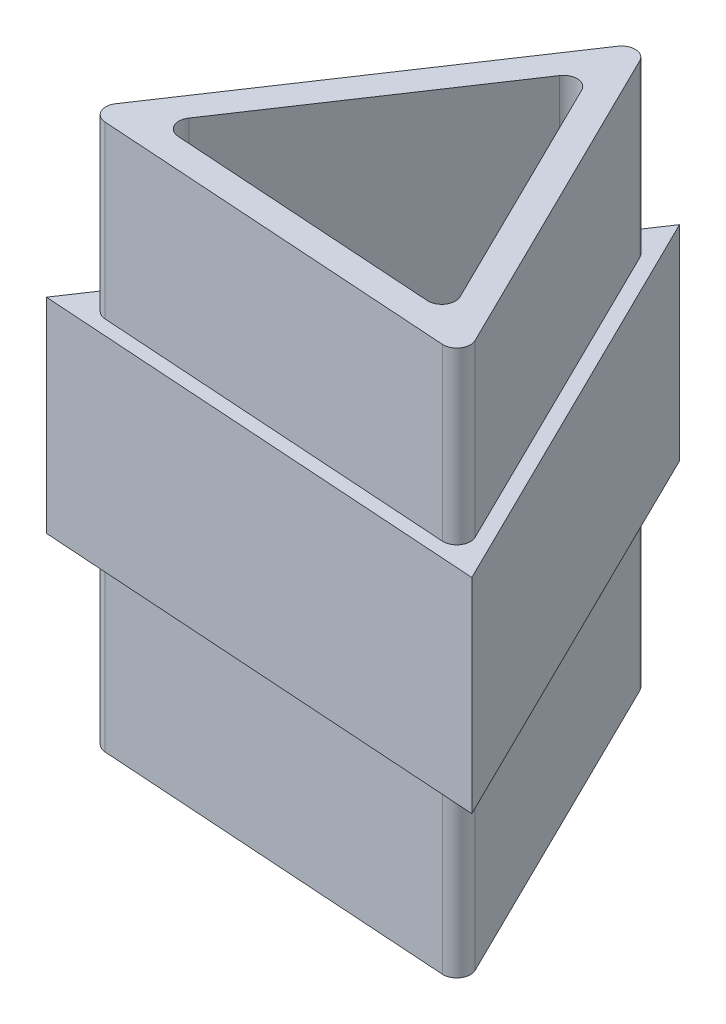
ISO-10303-21;
HEADER;
FILE_DESCRIPTION(('STEP AP214'),'2;1');
FILE_NAME('part.step','',(''),(''),'','','');
FILE_SCHEMA(('AUTOMOTIVE_DESIGN { 1 0 10303 214 1 1 1 1 }'));
ENDSEC;
DATA;
#1=APPLICATION_CONTEXT('core data for automotive mechanical design processes');
#2=APPLICATION_PROTOCOL_DEFINITION('international standard','automotive_design',2000,#1);
#3=PRODUCT_CONTEXT('',#1,'mechanical');
#4=PRODUCT('Part','Part','',(#3));
#5=PRODUCT_RELATED_PRODUCT_CATEGORY('part','',(#4));
#6=PRODUCT_DEFINITION_FORMATION('','',#4);
#7=PRODUCT_DEFINITION_CONTEXT('part definition',#1,'design');
#8=PRODUCT_DEFINITION('design','',#6,#7);
#9=PRODUCT_DEFINITION_SHAPE('','',#8);
#10=(LENGTH_UNIT() NAMED_UNIT(*) SI_UNIT(.MILLI.,.METRE.));
#11=(NAMED_UNIT(*) PLANE_ANGLE_UNIT() SI_UNIT($,.RADIAN.));
#12=(NAMED_UNIT(*) SI_UNIT($,.STERADIAN.) SOLID_ANGLE_UNIT());
#13=UNCERTAINTY_MEASURE_WITH_UNIT(LENGTH_MEASURE(1.E-05),#10,'distance_accuracy_value','');
#14=(GEOMETRIC_REPRESENTATION_CONTEXT(3) GLOBAL_UNCERTAINTY_ASSIGNED_CONTEXT((#13)) GLOBAL_UNIT_ASSIGNED_CONTEXT((#10,
#11,#12)) REPRESENTATION_CONTEXT('',''));
#15=CARTESIAN_POINT('',(0.,0.,0.));
#16=DIRECTION('',(0.,0.,1.));
#17=DIRECTION('',(1.,0.,0.));
#18=AXIS2_PLACEMENT_3D('',#15,#16,#17);
#19=CARTESIAN_POINT('',(13.2571720646144,40.,9.62890645420066));
#20=DIRECTION('',(-0.897061492286656,0.,0.441905735487149));
#21=DIRECTION('',(0.441905735487149,0.,0.897061492286656));
#22=AXIS2_PLACEMENT_3D('',#19,#20,#21);
#23=PLANE('',#22);
#24=DIRECTION('',(0.441905735487149,0.,0.897061492286656));
#25=VECTOR('',#24,1.);
#26=CARTESIAN_POINT('',(12.4917688785946,27.5,8.07515037204662));
#27=LINE('',#26,#25);
#28=CARTESIAN_POINT('',(0.765403186019763,27.5,-15.729182232245));
#29=VERTEX_POINT('',#28);
#30=CARTESIAN_POINT('',(12.4917688785946,27.5,8.07515037204662));
#31=VERTEX_POINT('',#30);
#32=EDGE_CURVE('E214',#29,#31,#27,.T.);
#33=ORIENTED_EDGE('',*,*,#32,.F.);
#34=DIRECTION('',(0.,-1.,0.));
#35=VECTOR('',#34,1.);
#36=CARTESIAN_POINT('',(0.765403186019763,40.,-15.729182232245));
#37=LINE('',#36,#35);
#38=CARTESIAN_POINT('',(0.765403186019765,40.,-15.729182232245));
#39=VERTEX_POINT('',#38);
#40=EDGE_CURVE('E309',#29,#39,#37,.F.);
#41=ORIENTED_EDGE('',*,*,#40,.T.);
#42=DIRECTION('',(-0.441905735487149,0.,-0.897061492286656));
#43=VECTOR('',#42,1.);
#44=CARTESIAN_POINT('',(13.2571720646144,40.,9.62890645420066));
#45=LINE('',#44,#43);
#46=CARTESIAN_POINT('',(12.4917688785946,40.,8.07515037204662));
#47=VERTEX_POINT('',#46);
#48=EDGE_CURVE('E258',#47,#39,#45,.T.);
#49=ORIENTED_EDGE('',*,*,#48,.F.);
#50=DIRECTION('',(0.,-1.,0.));
#51=VECTOR('',#50,1.);
#52=CARTESIAN_POINT('',(12.4917688785946,40.,8.07515037204662));
#53=LINE('',#52,#51);
#54=EDGE_CURVE('E313',#47,#31,#53,.T.);
#55=ORIENTED_EDGE('',*,*,#54,.T.);
#56=EDGE_LOOP('',(#33,#41,#49,#55));
#57=FACE_BOUND('',#56,.T.);
#58=ADVANCED_FACE('F33',(#57),#23,.F.);
#59=CARTESIAN_POINT('',(0.,40.,-17.282938314399));
#60=DIRECTION('',(0.831232339153244,0.,0.55592517333345));
#61=DIRECTION('',(0.55592517333345,0.,-0.831232339153244));
#62=AXIS2_PLACEMENT_3D('',#59,#60,#61);
#63=PLANE('',#62);
#64=DIRECTION('',(0.55592517333345,0.,-0.831232339153244));
#65=VECTOR('',#64,1.);
#66=CARTESIAN_POINT('',(-0.96289064542014,27.5,-15.8432016700913));
#67=LINE('',#66,#65);
#68=CARTESIAN_POINT('',(-15.7148645545836,27.5,6.21429521589074));
#69=VERTEX_POINT('',#68);
#70=CARTESIAN_POINT('',(-0.96289064542014,27.5,-15.8432016700913));
#71=VERTEX_POINT('',#70);
#72=EDGE_CURVE('E210',#69,#71,#67,.T.);
#73=ORIENTED_EDGE('',*,*,#72,.F.);
#74=DIRECTION('',(0.,-1.,0.));
#75=VECTOR('',#74,1.);
#76=CARTESIAN_POINT('',(-15.7148645545836,40.,6.21429521589074));
#77=LINE('',#76,#75);
#78=CARTESIAN_POINT('',(-15.7148645545836,40.,6.21429521589074));
#79=VERTEX_POINT('',#78);
#80=EDGE_CURVE('E301',#69,#79,#77,.F.);
#81=ORIENTED_EDGE('',*,*,#80,.T.);
#82=DIRECTION('',(-0.55592517333345,0.,0.831232339153244));
#83=VECTOR('',#82,1.);
#84=CARTESIAN_POINT('',(0.,40.,-17.282938314399));
#85=LINE('',#84,#83);
#86=CARTESIAN_POINT('',(-0.96289064542014,40.,-15.8432016700913));
#87=VERTEX_POINT('',#86);
#88=EDGE_CURVE('E261',#87,#79,#85,.T.);
#89=ORIENTED_EDGE('',*,*,#88,.F.);
#90=DIRECTION('',(0.,-1.,0.));
#91=VECTOR('',#90,1.);
#92=CARTESIAN_POINT('',(-0.96289064542014,40.,-15.8432016700913));
#93=LINE('',#92,#91);
#94=EDGE_CURVE('E186',#87,#71,#93,.T.);
#95=ORIENTED_EDGE('',*,*,#94,.T.);
#96=EDGE_LOOP('',(#73,#81,#89,#95));
#97=FACE_BOUND('',#96,.T.);
#98=ADVANCED_FACE('F364',(#97),#63,.F.);
#99=CARTESIAN_POINT('',(-16.6777552000037,40.,7.6540318601985));
#100=DIRECTION('',(0.0658291531334048,0.,-0.997830908820597));
#101=DIRECTION('',(-0.997830908820597,0.,-0.0658291531334048));
#102=AXIS2_PLACEMENT_3D('',#99,#100,#101);
#103=PLANE('',#102);
#104=DIRECTION('',(-0.997830908820597,0.,-0.0658291531334048));
#105=VECTOR('',#104,1.);
#106=CARTESIAN_POINT('',(-14.9494613685638,27.5,7.76805129804479));
#107=LINE('',#106,#105);
#108=CARTESIAN_POINT('',(11.5288782331745,27.5,9.51488701635437));
#109=VERTEX_POINT('',#108);
#110=CARTESIAN_POINT('',(-14.9494613685638,27.5,7.76805129804479));
#111=VERTEX_POINT('',#110);
#112=EDGE_CURVE('E206',#109,#111,#107,.T.);
#113=ORIENTED_EDGE('',*,*,#112,.F.);
#114=DIRECTION('',(0.,-1.,0.));
#115=VECTOR('',#114,1.);
#116=CARTESIAN_POINT('',(11.5288782331745,40.,9.51488701635437));
#117=LINE('',#116,#115);
#118=CARTESIAN_POINT('',(11.5288782331745,40.,9.51488701635437));
#119=VERTEX_POINT('',#118);
#120=EDGE_CURVE('E289',#109,#119,#117,.F.);
#121=ORIENTED_EDGE('',*,*,#120,.T.);
#122=DIRECTION('',(0.997830908820597,0.,0.0658291531334048));
#123=VECTOR('',#122,1.);
#124=CARTESIAN_POINT('',(-16.6777552000037,40.,7.6540318601985));
#125=LINE('',#124,#123);
#126=CARTESIAN_POINT('',(-14.9494613685638,40.,7.76805129804479));
#127=VERTEX_POINT('',#126);
#128=EDGE_CURVE('E265',#127,#119,#125,.T.);
#129=ORIENTED_EDGE('',*,*,#128,.F.);
#130=DIRECTION('',(0.,-1.,0.));
#131=VECTOR('',#130,1.);
#132=CARTESIAN_POINT('',(-14.9494613685638,40.,7.76805129804479));
#133=LINE('',#132,#131);
#134=EDGE_CURVE('E293',#127,#111,#133,.T.);
#135=ORIENTED_EDGE('',*,*,#134,.T.);
#136=EDGE_LOOP('',(#113,#121,#129,#135));
#137=FACE_BOUND('',#136,.T.);
#138=ADVANCED_FACE('F370',(#137),#103,.F.);
#139=CARTESIAN_POINT('',(-14.8836322154304,40.,6.77022038922419));
#140=DIRECTION('',(0.,-1.,0.));
#141=DIRECTION('',(0.,0.,-1.));
#142=AXIS2_PLACEMENT_3D('',#139,#140,#141);
#143=CYLINDRICAL_SURFACE('',#142,1.);
#144=ORIENTED_EDGE('',*,*,#80,.F.);
#145=CARTESIAN_POINT('',(-14.8836322154304,27.5,6.77022038922419));
#146=DIRECTION('',(0.,-1.,0.));
#147=DIRECTION('',(0.,0.,-1.));
#148=AXIS2_PLACEMENT_3D('',#145,#146,#147);
#149=CIRCLE('',#148,1.);
#150=EDGE_CURVE('E208',#111,#69,#149,.T.);
#151=ORIENTED_EDGE('',*,*,#150,.F.);
#152=ORIENTED_EDGE('',*,*,#134,.F.);
#153=CARTESIAN_POINT('',(-14.8836322154304,40.,6.77022038922419));
#154=DIRECTION('',(0.,1.,0.));
#155=DIRECTION('',(0.,0.,1.));
#156=AXIS2_PLACEMENT_3D('',#153,#154,#155);
#157=CIRCLE('',#156,1.);
#158=EDGE_CURVE('E307',#79,#127,#157,.T.);
#159=ORIENTED_EDGE('',*,*,#158,.F.);
#160=EDGE_LOOP('',(#144,#151,#152,#159));
#161=FACE_BOUND('',#160,.T.);
#162=ADVANCED_FACE('F402',(#161),#143,.T.);
#163=CARTESIAN_POINT('',(11.5947073863079,40.,8.51705610753377));
#164=DIRECTION('',(0.,-1.,0.));
#165=DIRECTION('',(0.,0.,-1.));
#166=AXIS2_PLACEMENT_3D('',#163,#164,#165);
#167=CYLINDRICAL_SURFACE('',#166,1.);
#168=ORIENTED_EDGE('',*,*,#120,.F.);
#169=CARTESIAN_POINT('',(11.5947073863079,27.5,8.51705610753377));
#170=DIRECTION('',(0.,-1.,0.));
#171=DIRECTION('',(0.,0.,-1.));
#172=AXIS2_PLACEMENT_3D('',#169,#170,#171);
#173=CIRCLE('',#172,1.);
#174=EDGE_CURVE('E204',#31,#109,#173,.T.);
#175=ORIENTED_EDGE('',*,*,#174,.F.);
#176=ORIENTED_EDGE('',*,*,#54,.F.);
#177=CARTESIAN_POINT('',(11.5947073863079,40.,8.51705610753377));
#178=DIRECTION('',(0.,1.,0.));
#179=DIRECTION('',(0.,0.,1.));
#180=AXIS2_PLACEMENT_3D('',#177,#178,#179);
#181=CIRCLE('',#180,1.);
#182=EDGE_CURVE('E305',#119,#47,#181,.T.);
#183=ORIENTED_EDGE('',*,*,#182,.F.);
#184=EDGE_LOOP('',(#168,#175,#176,#183));
#185=FACE_BOUND('',#184,.T.);
#186=ADVANCED_FACE('F395',(#185),#167,.T.);
#187=CARTESIAN_POINT('',(-0.131658306266894,40.,-15.2872764967578));
#188=DIRECTION('',(0.,-1.,0.));
#189=DIRECTION('',(0.,0.,-1.));
#190=AXIS2_PLACEMENT_3D('',#187,#188,#189);
#191=CYLINDRICAL_SURFACE('',#190,1.);
#192=ORIENTED_EDGE('',*,*,#40,.F.);
#193=CARTESIAN_POINT('',(-0.131658306266894,27.5,-15.2872764967578));
#194=DIRECTION('',(0.,-1.,0.));
#195=DIRECTION('',(0.,0.,-1.));
#196=AXIS2_PLACEMENT_3D('',#193,#194,#195);
#197=CIRCLE('',#196,1.);
#198=EDGE_CURVE('E212',#71,#29,#197,.T.);
#199=ORIENTED_EDGE('',*,*,#198,.F.);
#200=ORIENTED_EDGE('',*,*,#94,.F.);
#201=CARTESIAN_POINT('',(-0.131658306266894,40.,-15.2872764967578));
#202=DIRECTION('',(0.,1.,0.));
#203=DIRECTION('',(0.,0.,1.));
#204=AXIS2_PLACEMENT_3D('',#201,#202,#203);
#205=CIRCLE('',#204,1.);
#206=EDGE_CURVE('E303',#39,#87,#205,.T.);
#207=ORIENTED_EDGE('',*,*,#206,.F.);
#208=EDGE_LOOP('',(#192,#199,#200,#207));
#209=FACE_BOUND('',#208,.T.);
#210=ADVANCED_FACE('F400',(#209),#191,.T.);
#211=CARTESIAN_POINT('',(0.,40.,0.));
#212=DIRECTION('',(0.,1.,0.));
#213=DIRECTION('',(0.,0.,1.));
#214=AXIS2_PLACEMENT_3D('',#211,#212,#213);
#215=PLANE('',#214);
#216=ORIENTED_EDGE('',*,*,#88,.T.);
#217=ORIENTED_EDGE('',*,*,#158,.T.);
#218=ORIENTED_EDGE('',*,*,#128,.T.);
#219=ORIENTED_EDGE('',*,*,#182,.T.);
#220=ORIENTED_EDGE('',*,*,#48,.T.);
#221=ORIENTED_EDGE('',*,*,#206,.T.);
#222=EDGE_LOOP('',(#216,#217,#218,#219,#220,#221));
#223=FACE_BOUND('',#222,.T.);
#224=DIRECTION('',(-0.555925173333446,0.,0.831232339153247));
#225=VECTOR('',#224,1.);
#226=CARTESIAN_POINT('',(-0.263316612533787,40.,-13.2916146791165));
#227=LINE('',#226,#225);
#228=CARTESIAN_POINT('',(-1.22620725795385,40.,-11.8518780348088));
#229=VERTEX_POINT('',#228);
#230=CARTESIAN_POINT('',(-12.1266185854368,40.,4.44667227394209));
#231=VERTEX_POINT('',#230);
#232=EDGE_CURVE('E243',#229,#231,#227,.T.);
#233=ORIENTED_EDGE('',*,*,#232,.F.);
#234=CARTESIAN_POINT('',(-0.394974918800601,40.,-11.2959528614753));
#235=DIRECTION('',(0.,1.,0.));
#236=DIRECTION('',(0.,0.,1.));
#237=AXIS2_PLACEMENT_3D('',#234,#235,#236);
#238=CIRCLE('',#237,1.);
#239=CARTESIAN_POINT('',(0.502086573486053,40.,-11.7378585969625));
#240=VERTEX_POINT('',#239);
#241=EDGE_CURVE('E322',#229,#240,#238,.F.);
#242=ORIENTED_EDGE('',*,*,#241,.T.);
#243=DIRECTION('',(-0.441905735487152,0.,-0.897061492286655));
#244=VECTOR('',#243,1.);
#245=CARTESIAN_POINT('',(9.93224270800136,40.,7.40520576086688));
#246=LINE('',#245,#244);
#247=CARTESIAN_POINT('',(9.16683952198152,40.,5.85144967871283));
#248=VERTEX_POINT('',#247);
#249=EDGE_CURVE('E240',#248,#240,#246,.T.);
#250=ORIENTED_EDGE('',*,*,#249,.F.);
#251=CARTESIAN_POINT('',(8.26977802969486,40.,6.29335541419999));
#252=DIRECTION('',(0.,1.,0.));
#253=DIRECTION('',(0.,0.,1.));
#254=AXIS2_PLACEMENT_3D('',#251,#252,#253);
#255=CIRCLE('',#254,1.);
#256=CARTESIAN_POINT('',(8.20394887656145,40.,7.29118632302059));
#257=VERTEX_POINT('',#256);
#258=EDGE_CURVE('E318',#248,#257,#255,.F.);
#259=ORIENTED_EDGE('',*,*,#258,.T.);
#260=DIRECTION('',(0.997830908820597,0.,0.0658291531334074));
#261=VECTOR('',#260,1.);
#262=CARTESIAN_POINT('',(-13.0895092308569,40.,5.88640891824984));
#263=LINE('',#262,#261);
#264=CARTESIAN_POINT('',(-11.361215399417,40.,6.00042835609613));
#265=VERTEX_POINT('',#264);
#266=EDGE_CURVE('E247',#265,#257,#263,.T.);
#267=ORIENTED_EDGE('',*,*,#266,.F.);
#268=CARTESIAN_POINT('',(-11.2953862462835,40.,5.00259744727553));
#269=DIRECTION('',(0.,1.,0.));
#270=DIRECTION('',(0.,0.,1.));
#271=AXIS2_PLACEMENT_3D('',#268,#269,#270);
#272=CIRCLE('',#271,1.);
#273=EDGE_CURVE('E11',#265,#231,#272,.F.);
#274=ORIENTED_EDGE('',*,*,#273,.T.);
#275=EDGE_LOOP('',(#233,#242,#250,#259,#267,#274));
#276=FACE_BOUND('',#275,.T.);
#277=ADVANCED_FACE('F338',(#223,#276),#215,.T.);
#278=CARTESIAN_POINT('',(0.,0.,0.));
#279=DIRECTION('',(0.,1.,0.));
#280=DIRECTION('',(0.,0.,1.));
#281=AXIS2_PLACEMENT_3D('',#278,#279,#280);
#282=PLANE('',#281);
#283=DIRECTION('',(0.997830908820597,0.,0.0658291531334048));
#284=VECTOR('',#283,1.);
#285=CARTESIAN_POINT('',(-16.6777552000037,0.,7.6540318601985));
#286=LINE('',#285,#284);
#287=CARTESIAN_POINT('',(-14.9494613685638,0.,7.76805129804479));
#288=VERTEX_POINT('',#287);
#289=CARTESIAN_POINT('',(11.5288782331745,0.,9.51488701635437));
#290=VERTEX_POINT('',#289);
#291=EDGE_CURVE('E262',#288,#290,#286,.T.);
#292=ORIENTED_EDGE('',*,*,#291,.F.);
#293=CARTESIAN_POINT('',(-14.8836322154304,0.,6.77022038922419));
#294=DIRECTION('',(0.,1.,0.));
#295=DIRECTION('',(0.,0.,1.));
#296=AXIS2_PLACEMENT_3D('',#293,#294,#295);
#297=CIRCLE('',#296,1.);
#298=CARTESIAN_POINT('',(-15.7148645545836,0.,6.21429521589074));
#299=VERTEX_POINT('',#298);
#300=EDGE_CURVE('E187',#288,#299,#297,.F.);
#301=ORIENTED_EDGE('',*,*,#300,.T.);
#302=DIRECTION('',(-0.55592517333345,0.,0.831232339153244));
#303=VECTOR('',#302,1.);
#304=CARTESIAN_POINT('',(0.,0.,-17.282938314399));
#305=LINE('',#304,#303);
#306=CARTESIAN_POINT('',(-0.96289064542014,0.,-15.8432016700913));
#307=VERTEX_POINT('',#306);
#308=EDGE_CURVE('E271',#307,#299,#305,.T.);
#309=ORIENTED_EDGE('',*,*,#308,.F.);
#310=CARTESIAN_POINT('',(-0.131658306266894,0.,-15.2872764967578));
#311=DIRECTION('',(0.,1.,0.));
#312=DIRECTION('',(0.,0.,1.));
#313=AXIS2_PLACEMENT_3D('',#310,#311,#312);
#314=CIRCLE('',#313,1.);
#315=CARTESIAN_POINT('',(0.765403186019765,0.,-15.729182232245));
#316=VERTEX_POINT('',#315);
#317=EDGE_CURVE('E182',#307,#316,#314,.F.);
#318=ORIENTED_EDGE('',*,*,#317,.T.);
#319=DIRECTION('',(-0.441905735487149,0.,-0.897061492286656));
#320=VECTOR('',#319,1.);
#321=CARTESIAN_POINT('',(13.2571720646144,0.,9.62890645420066));
#322=LINE('',#321,#320);
#323=CARTESIAN_POINT('',(12.4917688785946,0.,8.07515037204662));
#324=VERTEX_POINT('',#323);
#325=EDGE_CURVE('E250',#324,#316,#322,.T.);
#326=ORIENTED_EDGE('',*,*,#325,.F.);
#327=CARTESIAN_POINT('',(11.5947073863079,0.,8.51705610753377));
#328=DIRECTION('',(0.,1.,0.));
#329=DIRECTION('',(0.,0.,1.));
#330=AXIS2_PLACEMENT_3D('',#327,#328,#329);
#331=CIRCLE('',#330,1.);
#332=EDGE_CURVE('E297',#324,#290,#331,.F.);
#333=ORIENTED_EDGE('',*,*,#332,.T.);
#334=EDGE_LOOP('',(#292,#301,#309,#318,#326,#333));
#335=FACE_BOUND('',#334,.T.);
#336=DIRECTION('',(0.997830908820597,0.,0.0658291531334074));
#337=VECTOR('',#336,1.);
#338=CARTESIAN_POINT('',(-13.0895092308569,0.,5.88640891824984));
#339=LINE('',#338,#337);
#340=CARTESIAN_POINT('',(-11.361215399417,0.,6.00042835609613));
#341=VERTEX_POINT('',#340);
#342=CARTESIAN_POINT('',(8.20394887656145,0.,7.29118632302059));
#343=VERTEX_POINT('',#342);
#344=EDGE_CURVE('E244',#341,#343,#339,.T.);
#345=ORIENTED_EDGE('',*,*,#344,.T.);
#346=CARTESIAN_POINT('',(8.26977802969486,0.,6.29335541419999));
#347=DIRECTION('',(0.,1.,0.));
#348=DIRECTION('',(0.,0.,1.));
#349=AXIS2_PLACEMENT_3D('',#346,#347,#348);
#350=CIRCLE('',#349,1.);
#351=CARTESIAN_POINT('',(9.16683952198152,0.,5.85144967871283));
#352=VERTEX_POINT('',#351);
#353=EDGE_CURVE('E316',#343,#352,#350,.T.);
#354=ORIENTED_EDGE('',*,*,#353,.T.);
#355=DIRECTION('',(-0.441905735487152,0.,-0.897061492286655));
#356=VECTOR('',#355,1.);
#357=CARTESIAN_POINT('',(9.93224270800136,0.,7.40520576086688));
#358=LINE('',#357,#356);
#359=CARTESIAN_POINT('',(0.502086573486053,0.,-11.7378585969625));
#360=VERTEX_POINT('',#359);
#361=EDGE_CURVE('E239',#352,#360,#358,.T.);
#362=ORIENTED_EDGE('',*,*,#361,.T.);
#363=CARTESIAN_POINT('',(-0.394974918800601,0.,-11.2959528614753));
#364=DIRECTION('',(0.,1.,0.));
#365=DIRECTION('',(0.,0.,1.));
#366=AXIS2_PLACEMENT_3D('',#363,#364,#365);
#367=CIRCLE('',#366,1.);
#368=CARTESIAN_POINT('',(-1.22620725795385,0.,-11.8518780348088));
#369=VERTEX_POINT('',#368);
#370=EDGE_CURVE('E320',#360,#369,#367,.T.);
#371=ORIENTED_EDGE('',*,*,#370,.T.);
#372=DIRECTION('',(-0.555925173333446,0.,0.831232339153247));
#373=VECTOR('',#372,1.);
#374=CARTESIAN_POINT('',(-0.263316612533787,0.,-13.2916146791165));
#375=LINE('',#374,#373);
#376=CARTESIAN_POINT('',(-12.1266185854368,0.,4.44667227394209));
#377=VERTEX_POINT('',#376);
#378=EDGE_CURVE('E253',#369,#377,#375,.T.);
#379=ORIENTED_EDGE('',*,*,#378,.T.);
#380=CARTESIAN_POINT('',(-11.2953862462835,0.,5.00259744727553));
#381=DIRECTION('',(0.,1.,0.));
#382=DIRECTION('',(0.,0.,1.));
#383=AXIS2_PLACEMENT_3D('',#380,#381,#382);
#384=CIRCLE('',#383,1.);
#385=EDGE_CURVE('E41',#377,#341,#384,.T.);
#386=ORIENTED_EDGE('',*,*,#385,.T.);
#387=EDGE_LOOP('',(#345,#354,#362,#371,#379,#386));
#388=FACE_BOUND('',#387,.T.);
#389=ADVANCED_FACE('F325',(#335,#388),#282,.F.);
#390=CARTESIAN_POINT('',(0.765403186019763,12.5,-15.729182232245));
#391=VERTEX_POINT('',#390);
#392=EDGE_CURVE('E310',#316,#391,#37,.F.);
#393=ORIENTED_EDGE('',*,*,#392,.T.);
#394=DIRECTION('',(0.441905735487149,0.,0.897061492286656));
#395=VECTOR('',#394,1.);
#396=CARTESIAN_POINT('',(12.4917688785946,12.5,8.07515037204662));
#397=LINE('',#396,#395);
#398=CARTESIAN_POINT('',(12.4917688785946,12.5,8.07515037204662));
#399=VERTEX_POINT('',#398);
#400=EDGE_CURVE('E198',#391,#399,#397,.T.);
#401=ORIENTED_EDGE('',*,*,#400,.T.);
#402=EDGE_CURVE('E312',#399,#324,#53,.T.);
#403=ORIENTED_EDGE('',*,*,#402,.T.);
#404=ORIENTED_EDGE('',*,*,#325,.T.);
#405=EDGE_LOOP('',(#393,#401,#403,#404));
#406=FACE_BOUND('',#405,.T.);
#407=ADVANCED_FACE('F366',(#406),#23,.F.);
#408=CARTESIAN_POINT('',(-15.7148645545836,12.5,6.21429521589074));
#409=VERTEX_POINT('',#408);
#410=EDGE_CURVE('E192',#299,#409,#77,.F.);
#411=ORIENTED_EDGE('',*,*,#410,.T.);
#412=DIRECTION('',(0.55592517333345,0.,-0.831232339153244));
#413=VECTOR('',#412,1.);
#414=CARTESIAN_POINT('',(-0.96289064542014,12.5,-15.8432016700913));
#415=LINE('',#414,#413);
#416=CARTESIAN_POINT('',(-0.96289064542014,12.5,-15.8432016700913));
#417=VERTEX_POINT('',#416);
#418=EDGE_CURVE('E190',#409,#417,#415,.T.);
#419=ORIENTED_EDGE('',*,*,#418,.T.);
#420=EDGE_CURVE('E176',#417,#307,#93,.T.);
#421=ORIENTED_EDGE('',*,*,#420,.T.);
#422=ORIENTED_EDGE('',*,*,#308,.T.);
#423=EDGE_LOOP('',(#411,#419,#421,#422));
#424=FACE_BOUND('',#423,.T.);
#425=ADVANCED_FACE('F191',(#424),#63,.F.);
#426=CARTESIAN_POINT('',(11.5288782331745,12.5,9.51488701635437));
#427=VERTEX_POINT('',#426);
#428=EDGE_CURVE('E290',#290,#427,#117,.F.);
#429=ORIENTED_EDGE('',*,*,#428,.T.);
#430=DIRECTION('',(-0.997830908820597,0.,-0.0658291531334048));
#431=VECTOR('',#430,1.);
#432=CARTESIAN_POINT('',(-14.9494613685638,12.5,7.76805129804479));
#433=LINE('',#432,#431);
#434=CARTESIAN_POINT('',(-14.9494613685638,12.5,7.76805129804479));
#435=VERTEX_POINT('',#434);
#436=EDGE_CURVE('E48',#427,#435,#433,.T.);
#437=ORIENTED_EDGE('',*,*,#436,.T.);
#438=EDGE_CURVE('E292',#435,#288,#133,.T.);
#439=ORIENTED_EDGE('',*,*,#438,.T.);
#440=ORIENTED_EDGE('',*,*,#291,.T.);
#441=EDGE_LOOP('',(#429,#437,#439,#440));
#442=FACE_BOUND('',#441,.T.);
#443=ADVANCED_FACE('F380',(#442),#103,.F.);
#444=CARTESIAN_POINT('',(9.93224270800136,40.,7.40520576086688));
#445=DIRECTION('',(-0.897061492286655,0.,0.441905735487152));
#446=DIRECTION('',(0.441905735487152,0.,0.897061492286655));
#447=AXIS2_PLACEMENT_3D('',#444,#445,#446);
#448=PLANE('',#447);
#449=ORIENTED_EDGE('',*,*,#361,.F.);
#450=DIRECTION('',(0.,-1.,0.));
#451=VECTOR('',#450,1.);
#452=CARTESIAN_POINT('',(9.16683952198152,40.,5.85144967871283));
#453=LINE('',#452,#451);
#454=EDGE_CURVE('E282',#352,#248,#453,.F.);
#455=ORIENTED_EDGE('',*,*,#454,.T.);
#456=ORIENTED_EDGE('',*,*,#249,.T.);
#457=DIRECTION('',(0.,-1.,0.));
#458=VECTOR('',#457,1.);
#459=CARTESIAN_POINT('',(0.502086573486053,0.,-11.7378585969625));
#460=LINE('',#459,#458);
#461=EDGE_CURVE('E279',#240,#360,#460,.T.);
#462=ORIENTED_EDGE('',*,*,#461,.T.);
#463=EDGE_LOOP('',(#449,#455,#456,#462));
#464=FACE_BOUND('',#463,.T.);
#465=ADVANCED_FACE('F350',(#464),#448,.T.);
#466=CARTESIAN_POINT('',(-0.263316612533787,40.,-13.2916146791165));
#467=DIRECTION('',(0.831232339153247,0.,0.555925173333446));
#468=DIRECTION('',(0.555925173333446,0.,-0.831232339153247));
#469=AXIS2_PLACEMENT_3D('',#466,#467,#468);
#470=PLANE('',#469);
#471=ORIENTED_EDGE('',*,*,#378,.F.);
#472=DIRECTION('',(0.,-1.,0.));
#473=VECTOR('',#472,1.);
#474=CARTESIAN_POINT('',(-1.22620725795385,40.,-11.8518780348088));
#475=LINE('',#474,#473);
#476=EDGE_CURVE('E287',#369,#229,#475,.F.);
#477=ORIENTED_EDGE('',*,*,#476,.T.);
#478=ORIENTED_EDGE('',*,*,#232,.T.);
#479=DIRECTION('',(0.,-1.,0.));
#480=VECTOR('',#479,1.);
#481=CARTESIAN_POINT('',(-12.1266185854368,0.,4.44667227394209));
#482=LINE('',#481,#480);
#483=EDGE_CURVE('E284',#231,#377,#482,.T.);
#484=ORIENTED_EDGE('',*,*,#483,.T.);
#485=EDGE_LOOP('',(#471,#477,#478,#484));
#486=FACE_BOUND('',#485,.T.);
#487=ADVANCED_FACE('F341',(#486),#470,.T.);
#488=CARTESIAN_POINT('',(-13.0895092308569,40.,5.88640891824984));
#489=DIRECTION('',(0.0658291531334074,0.,-0.997830908820597));
#490=DIRECTION('',(-0.997830908820597,0.,-0.0658291531334074));
#491=AXIS2_PLACEMENT_3D('',#488,#489,#490);
#492=PLANE('',#491);
#493=ORIENTED_EDGE('',*,*,#266,.T.);
#494=DIRECTION('',(0.,-1.,0.));
#495=VECTOR('',#494,1.);
#496=CARTESIAN_POINT('',(8.20394887656145,0.,7.29118632302059));
#497=LINE('',#496,#495);
#498=EDGE_CURVE('E276',#257,#343,#497,.T.);
#499=ORIENTED_EDGE('',*,*,#498,.T.);
#500=ORIENTED_EDGE('',*,*,#344,.F.);
#501=DIRECTION('',(0.,-1.,0.));
#502=VECTOR('',#501,1.);
#503=CARTESIAN_POINT('',(-11.361215399417,40.,6.00042835609613));
#504=LINE('',#503,#502);
#505=EDGE_CURVE('E268',#341,#265,#504,.F.);
#506=ORIENTED_EDGE('',*,*,#505,.T.);
#507=EDGE_LOOP('',(#493,#499,#500,#506));
#508=FACE_BOUND('',#507,.T.);
#509=ADVANCED_FACE('F331',(#508),#492,.T.);
#510=CARTESIAN_POINT('',(8.26977802969486,40.,6.29335541419999));
#511=DIRECTION('',(0.,1.,0.));
#512=DIRECTION('',(0.,0.,1.));
#513=AXIS2_PLACEMENT_3D('',#510,#511,#512);
#514=CYLINDRICAL_SURFACE('',#513,1.);
#515=ORIENTED_EDGE('',*,*,#258,.F.);
#516=ORIENTED_EDGE('',*,*,#454,.F.);
#517=ORIENTED_EDGE('',*,*,#353,.F.);
#518=ORIENTED_EDGE('',*,*,#498,.F.);
#519=EDGE_LOOP('',(#515,#516,#517,#518));
#520=FACE_BOUND('',#519,.T.);
#521=ADVANCED_FACE('F353',(#520),#514,.F.);
#522=CARTESIAN_POINT('',(-0.394974918800601,40.,-11.2959528614753));
#523=DIRECTION('',(0.,1.,0.));
#524=DIRECTION('',(0.,0.,1.));
#525=AXIS2_PLACEMENT_3D('',#522,#523,#524);
#526=CYLINDRICAL_SURFACE('',#525,1.);
#527=ORIENTED_EDGE('',*,*,#241,.F.);
#528=ORIENTED_EDGE('',*,*,#476,.F.);
#529=ORIENTED_EDGE('',*,*,#370,.F.);
#530=ORIENTED_EDGE('',*,*,#461,.F.);
#531=EDGE_LOOP('',(#527,#528,#529,#530));
#532=FACE_BOUND('',#531,.T.);
#533=ADVANCED_FACE('F344',(#532),#526,.F.);
#534=CARTESIAN_POINT('',(-11.2953862462835,40.,5.00259744727553));
#535=DIRECTION('',(0.,1.,0.));
#536=DIRECTION('',(0.,0.,1.));
#537=AXIS2_PLACEMENT_3D('',#534,#535,#536);
#538=CYLINDRICAL_SURFACE('',#537,1.);
#539=ORIENTED_EDGE('',*,*,#273,.F.);
#540=ORIENTED_EDGE('',*,*,#505,.F.);
#541=ORIENTED_EDGE('',*,*,#385,.F.);
#542=ORIENTED_EDGE('',*,*,#483,.F.);
#543=EDGE_LOOP('',(#539,#540,#541,#542));
#544=FACE_BOUND('',#543,.T.);
#545=ADVANCED_FACE('F335',(#544),#538,.F.);
#546=CARTESIAN_POINT('',(-14.8836322154304,12.5,6.77022038922419));
#547=DIRECTION('',(0.,-1.,0.));
#548=DIRECTION('',(0.,0.,-1.));
#549=AXIS2_PLACEMENT_3D('',#546,#547,#548);
#550=CIRCLE('',#549,1.);
#551=EDGE_CURVE('E55',#435,#409,#550,.T.);
#552=ORIENTED_EDGE('',*,*,#551,.T.);
#553=ORIENTED_EDGE('',*,*,#410,.F.);
#554=ORIENTED_EDGE('',*,*,#300,.F.);
#555=ORIENTED_EDGE('',*,*,#438,.F.);
#556=EDGE_LOOP('',(#552,#553,#554,#555));
#557=FACE_BOUND('',#556,.T.);
#558=ADVANCED_FACE('F388',(#557),#143,.T.);
#559=CARTESIAN_POINT('',(11.5947073863079,12.5,8.51705610753377));
#560=DIRECTION('',(0.,-1.,0.));
#561=DIRECTION('',(0.,0.,-1.));
#562=AXIS2_PLACEMENT_3D('',#559,#560,#561);
#563=CIRCLE('',#562,1.);
#564=EDGE_CURVE('E216',#399,#427,#563,.T.);
#565=ORIENTED_EDGE('',*,*,#564,.T.);
#566=ORIENTED_EDGE('',*,*,#428,.F.);
#567=ORIENTED_EDGE('',*,*,#332,.F.);
#568=ORIENTED_EDGE('',*,*,#402,.F.);
#569=EDGE_LOOP('',(#565,#566,#567,#568));
#570=FACE_BOUND('',#569,.T.);
#571=ADVANCED_FACE('F391',(#570),#167,.T.);
#572=CARTESIAN_POINT('',(-0.131658306266894,12.5,-15.2872764967578));
#573=DIRECTION('',(0.,-1.,0.));
#574=DIRECTION('',(0.,0.,-1.));
#575=AXIS2_PLACEMENT_3D('',#572,#573,#574);
#576=CIRCLE('',#575,1.);
#577=EDGE_CURVE('E180',#417,#391,#576,.T.);
#578=ORIENTED_EDGE('',*,*,#577,.T.);
#579=ORIENTED_EDGE('',*,*,#392,.F.);
#580=ORIENTED_EDGE('',*,*,#317,.F.);
#581=ORIENTED_EDGE('',*,*,#420,.F.);
#582=EDGE_LOOP('',(#578,#579,#580,#581));
#583=FACE_BOUND('',#582,.T.);
#584=ADVANCED_FACE('F35',(#583),#191,.T.);
#585=CARTESIAN_POINT('',(0.,12.5,0.));
#586=DIRECTION('',(0.,-1.,0.));
#587=DIRECTION('',(0.,0.,-1.));
#588=AXIS2_PLACEMENT_3D('',#585,#586,#587);
#589=PLANE('',#588);
#590=DIRECTION('',(0.441905735487149,0.,0.897061492286656));
#591=VECTOR('',#590,1.);
#592=CARTESIAN_POINT('',(14.9196367429209,12.5,10.7407568008675));
#593=LINE('',#592,#591);
#594=CARTESIAN_POINT('',(0.131658306266751,12.5,-19.2786001320402));
#595=VERTEX_POINT('',#594);
#596=CARTESIAN_POINT('',(14.9196367429209,12.5,10.7407568008675));
#597=VERTEX_POINT('',#596);
#598=EDGE_CURVE('E217',#595,#597,#593,.T.);
#599=ORIENTED_EDGE('',*,*,#598,.T.);
#600=DIRECTION('',(-0.997830908820597,0.,-0.0658291531334047));
#601=VECTOR('',#600,1.);
#602=CARTESIAN_POINT('',(-18.471878184577,12.5,8.5378433311728));
#603=LINE('',#602,#601);
#604=CARTESIAN_POINT('',(-18.471878184577,12.5,8.5378433311728));
#605=VERTEX_POINT('',#604);
#606=EDGE_CURVE('E220',#597,#605,#603,.T.);
#607=ORIENTED_EDGE('',*,*,#606,.T.);
#608=DIRECTION('',(0.55592517333345,0.,-0.831232339153244));
#609=VECTOR('',#608,1.);
#610=CARTESIAN_POINT('',(-18.471878184577,12.5,8.5378433311728));
#611=LINE('',#610,#609);
#612=EDGE_CURVE('E223',#605,#595,#611,.T.);
#613=ORIENTED_EDGE('',*,*,#612,.T.);
#614=EDGE_LOOP('',(#599,#607,#613));
#615=FACE_BOUND('',#614,.T.);
#616=ORIENTED_EDGE('',*,*,#436,.F.);
#617=ORIENTED_EDGE('',*,*,#564,.F.);
#618=ORIENTED_EDGE('',*,*,#400,.F.);
#619=ORIENTED_EDGE('',*,*,#577,.F.);
#620=ORIENTED_EDGE('',*,*,#418,.F.);
#621=ORIENTED_EDGE('',*,*,#551,.F.);
#622=EDGE_LOOP('',(#616,#617,#618,#619,#620,#621));
#623=FACE_BOUND('',#622,.T.);
#624=ADVANCED_FACE('F196',(#615,#623),#589,.T.);
#625=CARTESIAN_POINT('',(0.,27.5,0.));
#626=DIRECTION('',(0.,-1.,0.));
#627=DIRECTION('',(0.,0.,-1.));
#628=AXIS2_PLACEMENT_3D('',#625,#626,#627);
#629=PLANE('',#628);
#630=DIRECTION('',(0.441905735487149,0.,0.897061492286656));
#631=VECTOR('',#630,1.);
#632=CARTESIAN_POINT('',(14.9196367429209,27.5,10.7407568008675));
#633=LINE('',#632,#631);
#634=CARTESIAN_POINT('',(0.131658306266751,27.5,-19.2786001320402));
#635=VERTEX_POINT('',#634);
#636=CARTESIAN_POINT('',(14.9196367429209,27.5,10.7407568008675));
#637=VERTEX_POINT('',#636);
#638=EDGE_CURVE('E200',#635,#637,#633,.T.);
#639=ORIENTED_EDGE('',*,*,#638,.F.);
#640=DIRECTION('',(0.55592517333345,0.,-0.831232339153244));
#641=VECTOR('',#640,1.);
#642=CARTESIAN_POINT('',(-18.471878184577,27.5,8.5378433311728));
#643=LINE('',#642,#641);
#644=CARTESIAN_POINT('',(-18.471878184577,27.5,8.5378433311728));
#645=VERTEX_POINT('',#644);
#646=EDGE_CURVE('E221',#645,#635,#643,.T.);
#647=ORIENTED_EDGE('',*,*,#646,.F.);
#648=DIRECTION('',(-0.997830908820597,0.,-0.0658291531334047));
#649=VECTOR('',#648,1.);
#650=CARTESIAN_POINT('',(-18.471878184577,27.5,8.5378433311728));
#651=LINE('',#650,#649);
#652=EDGE_CURVE('E228',#637,#645,#651,.T.);
#653=ORIENTED_EDGE('',*,*,#652,.F.);
#654=EDGE_LOOP('',(#639,#647,#653));
#655=FACE_BOUND('',#654,.T.);
#656=ORIENTED_EDGE('',*,*,#174,.T.);
#657=ORIENTED_EDGE('',*,*,#112,.T.);
#658=ORIENTED_EDGE('',*,*,#150,.T.);
#659=ORIENTED_EDGE('',*,*,#72,.T.);
#660=ORIENTED_EDGE('',*,*,#198,.T.);
#661=ORIENTED_EDGE('',*,*,#32,.T.);
#662=EDGE_LOOP('',(#656,#657,#658,#659,#660,#661));
#663=FACE_BOUND('',#662,.T.);
#664=ADVANCED_FACE('F427',(#655,#663),#629,.F.);
#665=CARTESIAN_POINT('',(14.9196367429209,12.5,10.7407568008675));
#666=DIRECTION('',(-0.897061492286656,0.,0.441905735487149));
#667=DIRECTION('',(0.441905735487149,0.,0.897061492286656));
#668=AXIS2_PLACEMENT_3D('',#665,#666,#667);
#669=PLANE('',#668);
#670=ORIENTED_EDGE('',*,*,#638,.T.);
#671=DIRECTION('',(0.,1.,0.));
#672=VECTOR('',#671,1.);
#673=CARTESIAN_POINT('',(14.9196367429209,12.5,10.7407568008675));
#674=LINE('',#673,#672);
#675=EDGE_CURVE('E236',#597,#637,#674,.T.);
#676=ORIENTED_EDGE('',*,*,#675,.F.);
#677=ORIENTED_EDGE('',*,*,#598,.F.);
#678=DIRECTION('',(0.,1.,0.));
#679=VECTOR('',#678,1.);
#680=CARTESIAN_POINT('',(0.131658306266751,12.5,-19.2786001320402));
#681=LINE('',#680,#679);
#682=EDGE_CURVE('E225',#595,#635,#681,.T.);
#683=ORIENTED_EDGE('',*,*,#682,.T.);
#684=EDGE_LOOP('',(#670,#676,#677,#683));
#685=FACE_BOUND('',#684,.T.);
#686=ADVANCED_FACE('F433',(#685),#669,.F.);
#687=CARTESIAN_POINT('',(-18.471878184577,12.5,8.5378433311728));
#688=DIRECTION('',(0.0658291531334047,0.,-0.997830908820597));
#689=DIRECTION('',(-0.997830908820597,0.,-0.0658291531334047));
#690=AXIS2_PLACEMENT_3D('',#687,#688,#689);
#691=PLANE('',#690);
#692=ORIENTED_EDGE('',*,*,#652,.T.);
#693=DIRECTION('',(0.,1.,0.));
#694=VECTOR('',#693,1.);
#695=CARTESIAN_POINT('',(-18.471878184577,12.5,8.5378433311728));
#696=LINE('',#695,#694);
#697=EDGE_CURVE('E233',#605,#645,#696,.T.);
#698=ORIENTED_EDGE('',*,*,#697,.F.);
#699=ORIENTED_EDGE('',*,*,#606,.F.);
#700=ORIENTED_EDGE('',*,*,#675,.T.);
#701=EDGE_LOOP('',(#692,#698,#699,#700));
#702=FACE_BOUND('',#701,.T.);
#703=ADVANCED_FACE('F440',(#702),#691,.F.);
#704=CARTESIAN_POINT('',(-18.471878184577,12.5,8.5378433311728));
#705=DIRECTION('',(0.831232339153244,0.,0.55592517333345));
#706=DIRECTION('',(0.55592517333345,0.,-0.831232339153244));
#707=AXIS2_PLACEMENT_3D('',#704,#705,#706);
#708=PLANE('',#707);
#709=ORIENTED_EDGE('',*,*,#646,.T.);
#710=ORIENTED_EDGE('',*,*,#682,.F.);
#711=ORIENTED_EDGE('',*,*,#612,.F.);
#712=ORIENTED_EDGE('',*,*,#697,.T.);
#713=EDGE_LOOP('',(#709,#710,#711,#712));
#714=FACE_BOUND('',#713,.T.);
#715=ADVANCED_FACE('F447',(#714),#708,.F.);
#716=CLOSED_SHELL('',(#58,#98,#138,#162,#186,#210,#277,#389,#407,#425,#443,#465,#487,#509,#521,
#533,#545,#558,#571,#584,#624,#664,#686,#703,#715));
#717=MANIFOLD_SOLID_BREP('B2',#716);
#718=ADVANCED_BREP_SHAPE_REPRESENTATION('',(#18,#717),#14);
#719=SHAPE_DEFINITION_REPRESENTATION(#9,#718);
ENDSEC;
END-ISO-10303-21;
